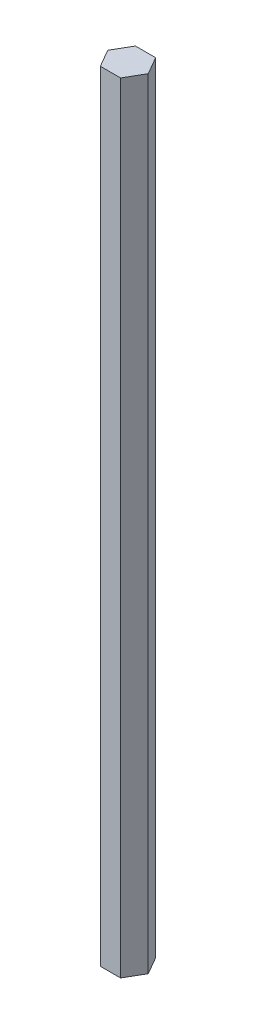
ISO-10303-21;
HEADER;
FILE_DESCRIPTION(('STEP AP214'),'2;1');
FILE_NAME('part.step','',(''),(''),'','','');
FILE_SCHEMA(('AUTOMOTIVE_DESIGN { 1 0 10303 214 1 1 1 1 }'));
ENDSEC;
DATA;
#1=APPLICATION_CONTEXT('core data for automotive mechanical design processes');
#2=APPLICATION_PROTOCOL_DEFINITION('international standard','automotive_design',2000,#1);
#3=PRODUCT_CONTEXT('',#1,'mechanical');
#4=PRODUCT('Part','Part','',(#3));
#5=PRODUCT_RELATED_PRODUCT_CATEGORY('part','',(#4));
#6=PRODUCT_DEFINITION_FORMATION('','',#4);
#7=PRODUCT_DEFINITION_CONTEXT('part definition',#1,'design');
#8=PRODUCT_DEFINITION('design','',#6,#7);
#9=PRODUCT_DEFINITION_SHAPE('','',#8);
#10=(LENGTH_UNIT() NAMED_UNIT(*) SI_UNIT(.MILLI.,.METRE.));
#11=(NAMED_UNIT(*) PLANE_ANGLE_UNIT() SI_UNIT($,.RADIAN.));
#12=(NAMED_UNIT(*) SI_UNIT($,.STERADIAN.) SOLID_ANGLE_UNIT());
#13=UNCERTAINTY_MEASURE_WITH_UNIT(LENGTH_MEASURE(1.E-05),#10,'distance_accuracy_value','');
#14=(GEOMETRIC_REPRESENTATION_CONTEXT(3) GLOBAL_UNCERTAINTY_ASSIGNED_CONTEXT((#13)) GLOBAL_UNIT_ASSIGNED_CONTEXT((#10,
#11,#12)) REPRESENTATION_CONTEXT('',''));
#15=CARTESIAN_POINT('',(0.,0.,0.));
#16=DIRECTION('',(0.,0.,1.));
#17=DIRECTION('',(1.,0.,0.));
#18=AXIS2_PLACEMENT_3D('',#15,#16,#17);
#19=CARTESIAN_POINT('',(1.44337567297409,55.5625,2.49999999999999));
#20=DIRECTION('',(-0.866025403784441,0.,-0.499999999999995));
#21=DIRECTION('',(-0.499999999999995,0.,0.866025403784441));
#22=AXIS2_PLACEMENT_3D('',#19,#20,#21);
#23=PLANE('',#22);
#24=DIRECTION('',(0.499999999999995,0.,-0.866025403784441));
#25=VECTOR('',#24,1.);
#26=CARTESIAN_POINT('',(1.44337567297409,-55.5625,2.49999999999999));
#27=LINE('',#26,#25);
#28=CARTESIAN_POINT('',(1.44337567297409,-55.5625,2.49999999999999));
#29=VERTEX_POINT('',#28);
#30=CARTESIAN_POINT('',(2.88675134594813,-55.5625,0.));
#31=VERTEX_POINT('',#30);
#32=EDGE_CURVE('E125',#29,#31,#27,.T.);
#33=ORIENTED_EDGE('',*,*,#32,.T.);
#34=DIRECTION('',(0.,-1.,0.));
#35=VECTOR('',#34,1.);
#36=CARTESIAN_POINT('',(2.88675134594813,55.5625,0.));
#37=LINE('',#36,#35);
#38=CARTESIAN_POINT('',(2.88675134594813,55.5625,0.));
#39=VERTEX_POINT('',#38);
#40=EDGE_CURVE('E11',#39,#31,#37,.T.);
#41=ORIENTED_EDGE('',*,*,#40,.F.);
#42=DIRECTION('',(0.499999999999995,0.,-0.866025403784441));
#43=VECTOR('',#42,1.);
#44=CARTESIAN_POINT('',(1.44337567297409,55.5625,2.49999999999999));
#45=LINE('',#44,#43);
#46=CARTESIAN_POINT('',(1.44337567297409,55.5625,2.49999999999999));
#47=VERTEX_POINT('',#46);
#48=EDGE_CURVE('E135',#47,#39,#45,.T.);
#49=ORIENTED_EDGE('',*,*,#48,.F.);
#50=DIRECTION('',(0.,-1.,0.));
#51=VECTOR('',#50,1.);
#52=CARTESIAN_POINT('',(1.44337567297409,55.5625,2.49999999999999));
#53=LINE('',#52,#51);
#54=EDGE_CURVE('E121',#47,#29,#53,.T.);
#55=ORIENTED_EDGE('',*,*,#54,.T.);
#56=EDGE_LOOP('',(#33,#41,#49,#55));
#57=FACE_BOUND('',#56,.T.);
#58=ADVANCED_FACE('F41',(#57),#23,.F.);
#59=CARTESIAN_POINT('',(2.88675134594813,55.5625,0.));
#60=DIRECTION('',(-0.866025403784438,0.,0.500000000000001));
#61=DIRECTION('',(0.500000000000001,0.,0.866025403784438));
#62=AXIS2_PLACEMENT_3D('',#59,#60,#61);
#63=PLANE('',#62);
#64=DIRECTION('',(-0.500000000000001,0.,-0.866025403784438));
#65=VECTOR('',#64,1.);
#66=CARTESIAN_POINT('',(2.88675134594813,-55.5625,0.));
#67=LINE('',#66,#65);
#68=CARTESIAN_POINT('',(1.44337567297406,-55.5625,-2.50000000000001));
#69=VERTEX_POINT('',#68);
#70=EDGE_CURVE('E128',#31,#69,#67,.T.);
#71=ORIENTED_EDGE('',*,*,#70,.T.);
#72=DIRECTION('',(0.,-1.,0.));
#73=VECTOR('',#72,1.);
#74=CARTESIAN_POINT('',(1.44337567297406,55.5625,-2.50000000000001));
#75=LINE('',#74,#73);
#76=CARTESIAN_POINT('',(1.44337567297406,55.5625,-2.50000000000001));
#77=VERTEX_POINT('',#76);
#78=EDGE_CURVE('E49',#77,#69,#75,.T.);
#79=ORIENTED_EDGE('',*,*,#78,.F.);
#80=DIRECTION('',(-0.500000000000001,0.,-0.866025403784438));
#81=VECTOR('',#80,1.);
#82=CARTESIAN_POINT('',(2.88675134594813,55.5625,0.));
#83=LINE('',#82,#81);
#84=EDGE_CURVE('E94',#39,#77,#83,.T.);
#85=ORIENTED_EDGE('',*,*,#84,.F.);
#86=ORIENTED_EDGE('',*,*,#40,.T.);
#87=EDGE_LOOP('',(#71,#79,#85,#86));
#88=FACE_BOUND('',#87,.T.);
#89=ADVANCED_FACE('F159',(#88),#63,.F.);
#90=CARTESIAN_POINT('',(1.44337567297406,55.5625,-2.50000000000001));
#91=DIRECTION('',(0.,0.,1.));
#92=DIRECTION('',(1.,0.,0.));
#93=AXIS2_PLACEMENT_3D('',#90,#91,#92);
#94=PLANE('',#93);
#95=DIRECTION('',(-1.,0.,0.));
#96=VECTOR('',#95,1.);
#97=CARTESIAN_POINT('',(1.44337567297406,-55.5625,-2.50000000000001));
#98=LINE('',#97,#96);
#99=CARTESIAN_POINT('',(-1.44337567297408,-55.5625,-2.5));
#100=VERTEX_POINT('',#99);
#101=EDGE_CURVE('E130',#69,#100,#98,.T.);
#102=ORIENTED_EDGE('',*,*,#101,.T.);
#103=DIRECTION('',(0.,-1.,0.));
#104=VECTOR('',#103,1.);
#105=CARTESIAN_POINT('',(-1.44337567297408,55.5625,-2.5));
#106=LINE('',#105,#104);
#107=CARTESIAN_POINT('',(-1.44337567297408,55.5625,-2.5));
#108=VERTEX_POINT('',#107);
#109=EDGE_CURVE('E116',#108,#100,#106,.T.);
#110=ORIENTED_EDGE('',*,*,#109,.F.);
#111=DIRECTION('',(-1.,0.,0.));
#112=VECTOR('',#111,1.);
#113=CARTESIAN_POINT('',(1.44337567297406,55.5625,-2.50000000000001));
#114=LINE('',#113,#112);
#115=EDGE_CURVE('E107',#77,#108,#114,.T.);
#116=ORIENTED_EDGE('',*,*,#115,.F.);
#117=ORIENTED_EDGE('',*,*,#78,.T.);
#118=EDGE_LOOP('',(#102,#110,#116,#117));
#119=FACE_BOUND('',#118,.T.);
#120=ADVANCED_FACE('F141',(#119),#94,.F.);
#121=CARTESIAN_POINT('',(-1.44337567297408,55.5625,-2.5));
#122=DIRECTION('',(0.866025403784442,0.,0.499999999999995));
#123=DIRECTION('',(0.499999999999995,0.,-0.866025403784442));
#124=AXIS2_PLACEMENT_3D('',#121,#122,#123);
#125=PLANE('',#124);
#126=DIRECTION('',(-0.499999999999995,0.,0.866025403784442));
#127=VECTOR('',#126,1.);
#128=CARTESIAN_POINT('',(-1.44337567297408,-55.5625,-2.5));
#129=LINE('',#128,#127);
#130=CARTESIAN_POINT('',(-2.88675134594813,-55.5625,0.));
#131=VERTEX_POINT('',#130);
#132=EDGE_CURVE('E115',#100,#131,#129,.T.);
#133=ORIENTED_EDGE('',*,*,#132,.T.);
#134=DIRECTION('',(0.,-1.,0.));
#135=VECTOR('',#134,1.);
#136=CARTESIAN_POINT('',(-2.88675134594813,55.5625,0.));
#137=LINE('',#136,#135);
#138=CARTESIAN_POINT('',(-2.88675134594813,55.5625,0.));
#139=VERTEX_POINT('',#138);
#140=EDGE_CURVE('E112',#139,#131,#137,.T.);
#141=ORIENTED_EDGE('',*,*,#140,.F.);
#142=DIRECTION('',(-0.499999999999995,0.,0.866025403784442));
#143=VECTOR('',#142,1.);
#144=CARTESIAN_POINT('',(-1.44337567297408,55.5625,-2.5));
#145=LINE('',#144,#143);
#146=EDGE_CURVE('E101',#108,#139,#145,.T.);
#147=ORIENTED_EDGE('',*,*,#146,.F.);
#148=ORIENTED_EDGE('',*,*,#109,.T.);
#149=EDGE_LOOP('',(#133,#141,#147,#148));
#150=FACE_BOUND('',#149,.T.);
#151=ADVANCED_FACE('F113',(#150),#125,.F.);
#152=CARTESIAN_POINT('',(-2.88675134594813,55.5625,0.));
#153=DIRECTION('',(0.866025403784434,0.,-0.500000000000007));
#154=DIRECTION('',(-0.500000000000007,0.,-0.866025403784435));
#155=AXIS2_PLACEMENT_3D('',#152,#153,#154);
#156=PLANE('',#155);
#157=DIRECTION('',(0.500000000000007,0.,0.866025403784434));
#158=VECTOR('',#157,1.);
#159=CARTESIAN_POINT('',(-2.88675134594813,-55.5625,0.));
#160=LINE('',#159,#158);
#161=CARTESIAN_POINT('',(-1.44337567297404,-55.5625,2.50000000000002));
#162=VERTEX_POINT('',#161);
#163=EDGE_CURVE('E80',#131,#162,#160,.T.);
#164=ORIENTED_EDGE('',*,*,#163,.T.);
#165=DIRECTION('',(0.,-1.,0.));
#166=VECTOR('',#165,1.);
#167=CARTESIAN_POINT('',(-1.44337567297404,55.5625,2.50000000000002));
#168=LINE('',#167,#166);
#169=CARTESIAN_POINT('',(-1.44337567297404,55.5625,2.50000000000002));
#170=VERTEX_POINT('',#169);
#171=EDGE_CURVE('E117',#170,#162,#168,.T.);
#172=ORIENTED_EDGE('',*,*,#171,.F.);
#173=DIRECTION('',(0.500000000000007,0.,0.866025403784434));
#174=VECTOR('',#173,1.);
#175=CARTESIAN_POINT('',(-2.88675134594813,55.5625,0.));
#176=LINE('',#175,#174);
#177=EDGE_CURVE('E105',#139,#170,#176,.T.);
#178=ORIENTED_EDGE('',*,*,#177,.F.);
#179=ORIENTED_EDGE('',*,*,#140,.T.);
#180=EDGE_LOOP('',(#164,#172,#178,#179));
#181=FACE_BOUND('',#180,.T.);
#182=ADVANCED_FACE('F119',(#181),#156,.F.);
#183=CARTESIAN_POINT('',(-1.44337567297404,55.5625,2.50000000000002));
#184=DIRECTION('',(0.,0.,-1.));
#185=DIRECTION('',(-1.,0.,0.));
#186=AXIS2_PLACEMENT_3D('',#183,#184,#185);
#187=PLANE('',#186);
#188=DIRECTION('',(1.,0.,0.));
#189=VECTOR('',#188,1.);
#190=CARTESIAN_POINT('',(-1.44337567297404,-55.5625,2.50000000000002));
#191=LINE('',#190,#189);
#192=EDGE_CURVE('E86',#162,#29,#191,.T.);
#193=ORIENTED_EDGE('',*,*,#192,.T.);
#194=ORIENTED_EDGE('',*,*,#54,.F.);
#195=DIRECTION('',(1.,0.,0.));
#196=VECTOR('',#195,1.);
#197=CARTESIAN_POINT('',(-1.44337567297404,55.5625,2.50000000000002));
#198=LINE('',#197,#196);
#199=EDGE_CURVE('E57',#170,#47,#198,.T.);
#200=ORIENTED_EDGE('',*,*,#199,.F.);
#201=ORIENTED_EDGE('',*,*,#171,.T.);
#202=EDGE_LOOP('',(#193,#194,#200,#201));
#203=FACE_BOUND('',#202,.T.);
#204=ADVANCED_FACE('F148',(#203),#187,.F.);
#205=CARTESIAN_POINT('',(0.,55.5625,0.));
#206=DIRECTION('',(0.,1.,0.));
#207=DIRECTION('',(0.,0.,1.));
#208=AXIS2_PLACEMENT_3D('',#205,#206,#207);
#209=PLANE('',#208);
#210=ORIENTED_EDGE('',*,*,#48,.T.);
#211=ORIENTED_EDGE('',*,*,#84,.T.);
#212=ORIENTED_EDGE('',*,*,#115,.T.);
#213=ORIENTED_EDGE('',*,*,#146,.T.);
#214=ORIENTED_EDGE('',*,*,#177,.T.);
#215=ORIENTED_EDGE('',*,*,#199,.T.);
#216=EDGE_LOOP('',(#210,#211,#212,#213,#214,#215));
#217=FACE_BOUND('',#216,.T.);
#218=ADVANCED_FACE('F103',(#217),#209,.T.);
#219=CARTESIAN_POINT('',(0.,-55.5625,0.));
#220=DIRECTION('',(0.,1.,0.));
#221=DIRECTION('',(0.,0.,1.));
#222=AXIS2_PLACEMENT_3D('',#219,#220,#221);
#223=PLANE('',#222);
#224=ORIENTED_EDGE('',*,*,#32,.F.);
#225=ORIENTED_EDGE('',*,*,#192,.F.);
#226=ORIENTED_EDGE('',*,*,#163,.F.);
#227=ORIENTED_EDGE('',*,*,#132,.F.);
#228=ORIENTED_EDGE('',*,*,#101,.F.);
#229=ORIENTED_EDGE('',*,*,#70,.F.);
#230=EDGE_LOOP('',(#224,#225,#226,#227,#228,#229));
#231=FACE_BOUND('',#230,.T.);
#232=ADVANCED_FACE('F144',(#231),#223,.F.);
#233=CLOSED_SHELL('',(#58,#89,#120,#151,#182,#204,#218,#232));
#234=MANIFOLD_SOLID_BREP('B2',#233);
#235=ADVANCED_BREP_SHAPE_REPRESENTATION('',(#18,#234),#14);
#236=SHAPE_DEFINITION_REPRESENTATION(#9,#235);
ENDSEC;
END-ISO-10303-21;
